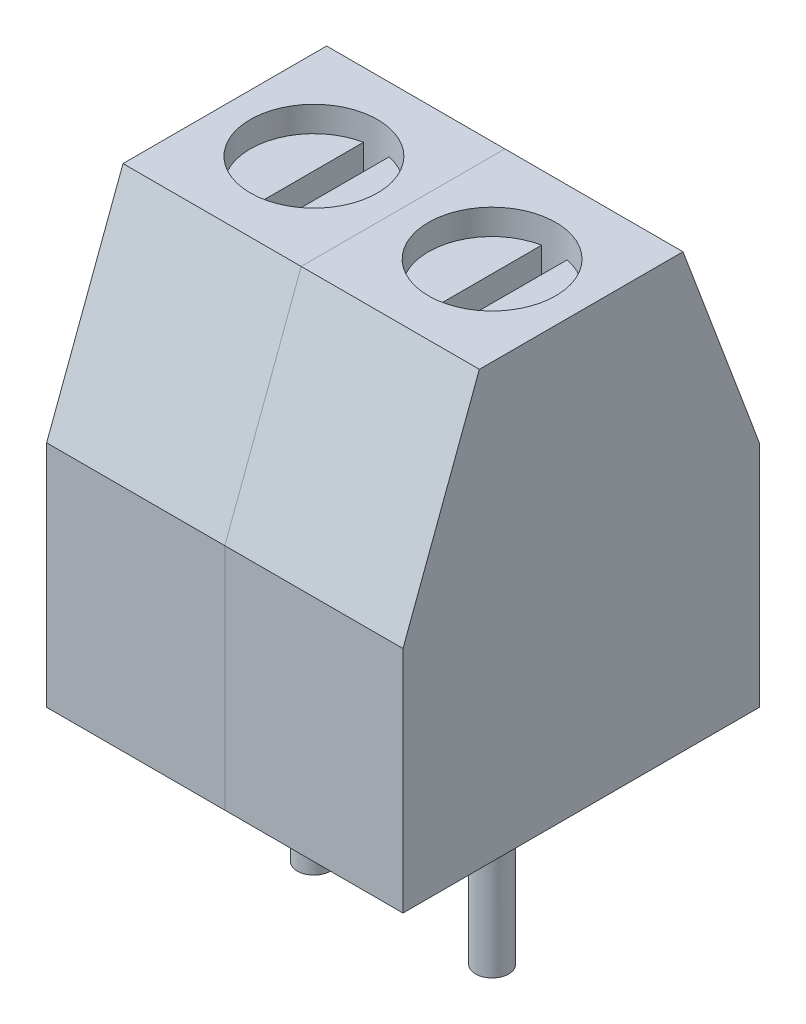
ISO-10303-21;
HEADER;
FILE_DESCRIPTION(('STEP AP214'),'2;1');
FILE_NAME('part.step','',(''),(''),'','','');
FILE_SCHEMA(('AUTOMOTIVE_DESIGN { 1 0 10303 214 1 1 1 1 }'));
ENDSEC;
DATA;
#1=APPLICATION_CONTEXT('core data for automotive mechanical design processes');
#2=APPLICATION_PROTOCOL_DEFINITION('international standard','automotive_design',2000,#1);
#3=PRODUCT_CONTEXT('',#1,'mechanical');
#4=PRODUCT('Part','Part','',(#3));
#5=PRODUCT_RELATED_PRODUCT_CATEGORY('part','',(#4));
#6=PRODUCT_DEFINITION_FORMATION('','',#4);
#7=PRODUCT_DEFINITION_CONTEXT('part definition',#1,'design');
#8=PRODUCT_DEFINITION('design','',#6,#7);
#9=PRODUCT_DEFINITION_SHAPE('','',#8);
#10=(LENGTH_UNIT() NAMED_UNIT(*) SI_UNIT(.MILLI.,.METRE.));
#11=(NAMED_UNIT(*) PLANE_ANGLE_UNIT() SI_UNIT($,.RADIAN.));
#12=(NAMED_UNIT(*) SI_UNIT($,.STERADIAN.) SOLID_ANGLE_UNIT());
#13=UNCERTAINTY_MEASURE_WITH_UNIT(LENGTH_MEASURE(1.E-05),#10,'distance_accuracy_value','');
#14=(GEOMETRIC_REPRESENTATION_CONTEXT(3) GLOBAL_UNCERTAINTY_ASSIGNED_CONTEXT((#13)) GLOBAL_UNIT_ASSIGNED_CONTEXT((#10,
#11,#12)) REPRESENTATION_CONTEXT('',''));
#15=CARTESIAN_POINT('',(0.,0.,0.));
#16=DIRECTION('',(0.,0.,1.));
#17=DIRECTION('',(1.,0.,0.));
#18=AXIS2_PLACEMENT_3D('',#15,#16,#17);
#19=CARTESIAN_POINT('',(5.25,8.,-3.5));
#20=DIRECTION('',(0.,1.,0.));
#21=DIRECTION('',(0.,0.,1.));
#22=AXIS2_PLACEMENT_3D('',#19,#20,#21);
#23=PLANE('',#22);
#24=DIRECTION('',(0.,0.,-1.));
#25=VECTOR('',#24,1.);
#26=CARTESIAN_POINT('',(5.49994995834108,8.,-4.72475508503753));
#27=LINE('',#26,#25);
#28=CARTESIAN_POINT('',(5.49994995834108,8.,-2.27524491496247));
#29=VERTEX_POINT('',#28);
#30=CARTESIAN_POINT('',(5.49994995834108,8.,-4.72475508503753));
#31=VERTEX_POINT('',#30);
#32=EDGE_CURVE('E176',#29,#31,#27,.T.);
#33=ORIENTED_EDGE('',*,*,#32,.F.);
#34=CARTESIAN_POINT('',(5.25,8.,-3.5));
#35=DIRECTION('',(0.,1.,0.));
#36=DIRECTION('',(0.,0.,1.));
#37=AXIS2_PLACEMENT_3D('',#34,#35,#36);
#38=CIRCLE('',#37,1.25);
#39=EDGE_CURVE('E158',#29,#31,#38,.T.);
#40=ORIENTED_EDGE('',*,*,#39,.T.);
#41=EDGE_LOOP('',(#33,#40));
#42=FACE_BOUND('',#41,.T.);
#43=ADVANCED_FACE('F48',(#42),#23,.T.);
#44=CARTESIAN_POINT('',(7.,0.,0.));
#45=DIRECTION('',(0.,0.,-1.));
#46=DIRECTION('',(-1.,0.,0.));
#47=AXIS2_PLACEMENT_3D('',#44,#45,#46);
#48=PLANE('',#47);
#49=DIRECTION('',(0.,-1.,0.));
#50=VECTOR('',#49,1.);
#51=CARTESIAN_POINT('',(3.5,0.,0.));
#52=LINE('',#51,#50);
#53=CARTESIAN_POINT('',(3.5,4.5,0.));
#54=VERTEX_POINT('',#53);
#55=CARTESIAN_POINT('',(3.5,0.,0.));
#56=VERTEX_POINT('',#55);
#57=EDGE_CURVE('E242',#54,#56,#52,.T.);
#58=ORIENTED_EDGE('',*,*,#57,.T.);
#59=DIRECTION('',(-1.,0.,0.));
#60=VECTOR('',#59,1.);
#61=CARTESIAN_POINT('',(7.,0.,0.));
#62=LINE('',#61,#60);
#63=CARTESIAN_POINT('',(7.,0.,0.));
#64=VERTEX_POINT('',#63);
#65=EDGE_CURVE('E56',#64,#56,#62,.T.);
#66=ORIENTED_EDGE('',*,*,#65,.F.);
#67=DIRECTION('',(0.,-1.,0.));
#68=VECTOR('',#67,1.);
#69=CARTESIAN_POINT('',(7.,0.,0.));
#70=LINE('',#69,#68);
#71=CARTESIAN_POINT('',(7.,4.5,0.));
#72=VERTEX_POINT('',#71);
#73=EDGE_CURVE('E232',#72,#64,#70,.T.);
#74=ORIENTED_EDGE('',*,*,#73,.F.);
#75=DIRECTION('',(-1.,0.,0.));
#76=VECTOR('',#75,1.);
#77=CARTESIAN_POINT('',(7.,4.5,0.));
#78=LINE('',#77,#76);
#79=EDGE_CURVE('E226',#72,#54,#78,.T.);
#80=ORIENTED_EDGE('',*,*,#79,.T.);
#81=EDGE_LOOP('',(#58,#66,#74,#80));
#82=FACE_BOUND('',#81,.T.);
#83=ADVANCED_FACE('F50',(#82),#48,.F.);
#84=CARTESIAN_POINT('',(7.,0.,0.));
#85=DIRECTION('',(0.,1.,0.));
#86=DIRECTION('',(0.,0.,1.));
#87=AXIS2_PLACEMENT_3D('',#84,#85,#86);
#88=PLANE('',#87);
#89=CARTESIAN_POINT('',(5.25,0.,-3.5));
#90=DIRECTION('',(0.,1.,0.));
#91=DIRECTION('',(0.,0.,1.));
#92=AXIS2_PLACEMENT_3D('',#89,#90,#91);
#93=CIRCLE('',#92,0.325);
#94=CARTESIAN_POINT('',(5.25,0.,-3.175));
#95=VERTEX_POINT('',#94);
#96=EDGE_CURVE('E12',#95,#95,#93,.F.);
#97=ORIENTED_EDGE('',*,*,#96,.F.);
#98=EDGE_LOOP('',(#97));
#99=FACE_BOUND('',#98,.T.);
#100=DIRECTION('',(0.,0.,-1.));
#101=VECTOR('',#100,1.);
#102=CARTESIAN_POINT('',(3.5,0.,0.));
#103=LINE('',#102,#101);
#104=CARTESIAN_POINT('',(3.5,0.,-7.));
#105=VERTEX_POINT('',#104);
#106=EDGE_CURVE('E240',#56,#105,#103,.T.);
#107=ORIENTED_EDGE('',*,*,#106,.T.);
#108=DIRECTION('',(-1.,0.,0.));
#109=VECTOR('',#108,1.);
#110=CARTESIAN_POINT('',(7.,0.,-7.));
#111=LINE('',#110,#109);
#112=CARTESIAN_POINT('',(7.,0.,-7.));
#113=VERTEX_POINT('',#112);
#114=EDGE_CURVE('E213',#113,#105,#111,.T.);
#115=ORIENTED_EDGE('',*,*,#114,.F.);
#116=DIRECTION('',(0.,0.,-1.));
#117=VECTOR('',#116,1.);
#118=CARTESIAN_POINT('',(7.,0.,0.));
#119=LINE('',#118,#117);
#120=EDGE_CURVE('E253',#64,#113,#119,.T.);
#121=ORIENTED_EDGE('',*,*,#120,.F.);
#122=ORIENTED_EDGE('',*,*,#65,.T.);
#123=EDGE_LOOP('',(#107,#115,#121,#122));
#124=FACE_BOUND('',#123,.T.);
#125=ADVANCED_FACE('F322',(#99,#124),#88,.F.);
#126=CARTESIAN_POINT('',(7.,0.,-7.));
#127=DIRECTION('',(0.,0.,1.));
#128=DIRECTION('',(1.,0.,0.));
#129=AXIS2_PLACEMENT_3D('',#126,#127,#128);
#130=PLANE('',#129);
#131=DIRECTION('',(-1.,0.,0.));
#132=VECTOR('',#131,1.);
#133=CARTESIAN_POINT('',(6.75,0.5,-7.));
#134=LINE('',#133,#132);
#135=CARTESIAN_POINT('',(6.75,0.5,-7.));
#136=VERTEX_POINT('',#135);
#137=CARTESIAN_POINT('',(3.75,0.5,-7.));
#138=VERTEX_POINT('',#137);
#139=EDGE_CURVE('E270',#136,#138,#134,.T.);
#140=ORIENTED_EDGE('',*,*,#139,.F.);
#141=DIRECTION('',(0.,-1.,0.));
#142=VECTOR('',#141,1.);
#143=CARTESIAN_POINT('',(6.75,0.5,-7.));
#144=LINE('',#143,#142);
#145=CARTESIAN_POINT('',(6.75,4.5,-7.));
#146=VERTEX_POINT('',#145);
#147=EDGE_CURVE('E210',#146,#136,#144,.T.);
#148=ORIENTED_EDGE('',*,*,#147,.F.);
#149=DIRECTION('',(-1.,0.,0.));
#150=VECTOR('',#149,1.);
#151=CARTESIAN_POINT('',(7.,4.5,-7.));
#152=LINE('',#151,#150);
#153=CARTESIAN_POINT('',(7.,4.5,-7.));
#154=VERTEX_POINT('',#153);
#155=EDGE_CURVE('E216',#154,#146,#152,.T.);
#156=ORIENTED_EDGE('',*,*,#155,.F.);
#157=DIRECTION('',(0.,1.,0.));
#158=VECTOR('',#157,1.);
#159=CARTESIAN_POINT('',(7.,0.,-7.));
#160=LINE('',#159,#158);
#161=EDGE_CURVE('E251',#113,#154,#160,.T.);
#162=ORIENTED_EDGE('',*,*,#161,.F.);
#163=ORIENTED_EDGE('',*,*,#114,.T.);
#164=DIRECTION('',(0.,1.,0.));
#165=VECTOR('',#164,1.);
#166=CARTESIAN_POINT('',(3.5,0.,-7.));
#167=LINE('',#166,#165);
#168=CARTESIAN_POINT('',(3.5,4.5,-7.));
#169=VERTEX_POINT('',#168);
#170=EDGE_CURVE('E237',#105,#169,#167,.T.);
#171=ORIENTED_EDGE('',*,*,#170,.T.);
#172=CARTESIAN_POINT('',(3.75,4.5,-7.));
#173=VERTEX_POINT('',#172);
#174=EDGE_CURVE('E219',#173,#169,#152,.T.);
#175=ORIENTED_EDGE('',*,*,#174,.F.);
#176=DIRECTION('',(0.,1.,0.));
#177=VECTOR('',#176,1.);
#178=CARTESIAN_POINT('',(3.75,0.5,-7.));
#179=LINE('',#178,#177);
#180=EDGE_CURVE('E71',#138,#173,#179,.T.);
#181=ORIENTED_EDGE('',*,*,#180,.F.);
#182=EDGE_LOOP('',(#140,#148,#156,#162,#163,#171,#175,#181));
#183=FACE_BOUND('',#182,.T.);
#184=ADVANCED_FACE('F320',(#183),#130,.F.);
#185=CARTESIAN_POINT('',(7.,8.5,-5.5));
#186=DIRECTION('',(0.,-0.351123441588392,0.936329177569045));
#187=DIRECTION('',(0.,-0.936329177569045,-0.351123441588392));
#188=AXIS2_PLACEMENT_3D('',#185,#186,#187);
#189=PLANE('',#188);
#190=DIRECTION('',(0.,0.936329177569045,0.351123441588392));
#191=VECTOR('',#190,1.);
#192=CARTESIAN_POINT('',(3.5,8.5,-5.5));
#193=LINE('',#192,#191);
#194=CARTESIAN_POINT('',(3.5,8.5,-5.5));
#195=VERTEX_POINT('',#194);
#196=EDGE_CURVE('E235',#169,#195,#193,.T.);
#197=ORIENTED_EDGE('',*,*,#196,.T.);
#198=DIRECTION('',(-1.,0.,0.));
#199=VECTOR('',#198,1.);
#200=CARTESIAN_POINT('',(7.,8.5,-5.5));
#201=LINE('',#200,#199);
#202=CARTESIAN_POINT('',(7.,8.5,-5.5));
#203=VERTEX_POINT('',#202);
#204=EDGE_CURVE('E220',#203,#195,#201,.T.);
#205=ORIENTED_EDGE('',*,*,#204,.F.);
#206=DIRECTION('',(0.,0.936329177569045,0.351123441588392));
#207=VECTOR('',#206,1.);
#208=CARTESIAN_POINT('',(7.,8.5,-5.5));
#209=LINE('',#208,#207);
#210=EDGE_CURVE('E249',#154,#203,#209,.T.);
#211=ORIENTED_EDGE('',*,*,#210,.F.);
#212=ORIENTED_EDGE('',*,*,#155,.T.);
#213=DIRECTION('',(1.,0.,0.));
#214=VECTOR('',#213,1.);
#215=CARTESIAN_POINT('',(6.75,4.5,-7.));
#216=LINE('',#215,#214);
#217=EDGE_CURVE('E265',#173,#146,#216,.T.);
#218=ORIENTED_EDGE('',*,*,#217,.F.);
#219=ORIENTED_EDGE('',*,*,#174,.T.);
#220=EDGE_LOOP('',(#197,#205,#211,#212,#218,#219));
#221=FACE_BOUND('',#220,.T.);
#222=ADVANCED_FACE('F291',(#221),#189,.F.);
#223=CARTESIAN_POINT('',(7.,8.5,-1.5));
#224=DIRECTION('',(0.,-1.,0.));
#225=DIRECTION('',(0.,0.,-1.));
#226=AXIS2_PLACEMENT_3D('',#223,#224,#225);
#227=PLANE('',#226);
#228=CARTESIAN_POINT('',(5.25,8.5,-3.5));
#229=DIRECTION('',(0.,1.,0.));
#230=DIRECTION('',(0.,0.,1.));
#231=AXIS2_PLACEMENT_3D('',#228,#229,#230);
#232=CIRCLE('',#231,1.25);
#233=CARTESIAN_POINT('',(5.25,8.5,-2.25));
#234=VERTEX_POINT('',#233);
#235=EDGE_CURVE('E196',#234,#234,#232,.T.);
#236=ORIENTED_EDGE('',*,*,#235,.F.);
#237=EDGE_LOOP('',(#236));
#238=FACE_BOUND('',#237,.T.);
#239=DIRECTION('',(0.,0.,1.));
#240=VECTOR('',#239,1.);
#241=CARTESIAN_POINT('',(3.5,8.5,-1.5));
#242=LINE('',#241,#240);
#243=CARTESIAN_POINT('',(3.5,8.5,-1.5));
#244=VERTEX_POINT('',#243);
#245=EDGE_CURVE('E233',#195,#244,#242,.T.);
#246=ORIENTED_EDGE('',*,*,#245,.T.);
#247=DIRECTION('',(-1.,0.,0.));
#248=VECTOR('',#247,1.);
#249=CARTESIAN_POINT('',(7.,8.5,-1.5));
#250=LINE('',#249,#248);
#251=CARTESIAN_POINT('',(7.,8.5,-1.5));
#252=VERTEX_POINT('',#251);
#253=EDGE_CURVE('E223',#252,#244,#250,.T.);
#254=ORIENTED_EDGE('',*,*,#253,.F.);
#255=DIRECTION('',(0.,0.,1.));
#256=VECTOR('',#255,1.);
#257=CARTESIAN_POINT('',(7.,8.5,-1.5));
#258=LINE('',#257,#256);
#259=EDGE_CURVE('E247',#203,#252,#258,.T.);
#260=ORIENTED_EDGE('',*,*,#259,.F.);
#261=ORIENTED_EDGE('',*,*,#204,.T.);
#262=EDGE_LOOP('',(#246,#254,#260,#261));
#263=FACE_BOUND('',#262,.T.);
#264=ADVANCED_FACE('F287',(#238,#263),#227,.F.);
#265=CARTESIAN_POINT('',(7.,8.5,-1.5));
#266=DIRECTION('',(0.,-0.351123441588392,-0.936329177569045));
#267=DIRECTION('',(0.,0.936329177569045,-0.351123441588392));
#268=AXIS2_PLACEMENT_3D('',#265,#266,#267);
#269=PLANE('',#268);
#270=DIRECTION('',(0.,-0.936329177569045,0.351123441588392));
#271=VECTOR('',#270,1.);
#272=CARTESIAN_POINT('',(3.5,8.5,-1.5));
#273=LINE('',#272,#271);
#274=EDGE_CURVE('E230',#244,#54,#273,.T.);
#275=ORIENTED_EDGE('',*,*,#274,.T.);
#276=ORIENTED_EDGE('',*,*,#79,.F.);
#277=DIRECTION('',(0.,-0.936329177569045,0.351123441588392));
#278=VECTOR('',#277,1.);
#279=CARTESIAN_POINT('',(7.,8.5,-1.5));
#280=LINE('',#279,#278);
#281=EDGE_CURVE('E229',#252,#72,#280,.T.);
#282=ORIENTED_EDGE('',*,*,#281,.F.);
#283=ORIENTED_EDGE('',*,*,#253,.T.);
#284=EDGE_LOOP('',(#275,#276,#282,#283));
#285=FACE_BOUND('',#284,.T.);
#286=ADVANCED_FACE('F290',(#285),#269,.F.);
#287=CARTESIAN_POINT('',(7.,0.,0.));
#288=DIRECTION('',(-1.,0.,0.));
#289=DIRECTION('',(0.,0.,1.));
#290=AXIS2_PLACEMENT_3D('',#287,#288,#289);
#291=PLANE('',#290);
#292=ORIENTED_EDGE('',*,*,#73,.T.);
#293=ORIENTED_EDGE('',*,*,#120,.T.);
#294=ORIENTED_EDGE('',*,*,#161,.T.);
#295=ORIENTED_EDGE('',*,*,#210,.T.);
#296=ORIENTED_EDGE('',*,*,#259,.T.);
#297=ORIENTED_EDGE('',*,*,#281,.T.);
#298=EDGE_LOOP('',(#292,#293,#294,#295,#296,#297));
#299=FACE_BOUND('',#298,.T.);
#300=ADVANCED_FACE('F310',(#299),#291,.F.);
#301=CARTESIAN_POINT('',(3.5,0.,0.));
#302=DIRECTION('',(-1.,0.,0.));
#303=DIRECTION('',(0.,0.,1.));
#304=AXIS2_PLACEMENT_3D('',#301,#302,#303);
#305=PLANE('',#304);
#306=ORIENTED_EDGE('',*,*,#57,.F.);
#307=ORIENTED_EDGE('',*,*,#274,.F.);
#308=ORIENTED_EDGE('',*,*,#245,.F.);
#309=ORIENTED_EDGE('',*,*,#196,.F.);
#310=ORIENTED_EDGE('',*,*,#170,.F.);
#311=ORIENTED_EDGE('',*,*,#106,.F.);
#312=EDGE_LOOP('',(#306,#307,#308,#309,#310,#311));
#313=FACE_BOUND('',#312,.T.);
#314=ADVANCED_FACE('F304',(#313),#305,.T.);
#315=CARTESIAN_POINT('',(6.75,0.5,-5.5));
#316=DIRECTION('',(1.,0.,0.));
#317=DIRECTION('',(0.,0.,-1.));
#318=AXIS2_PLACEMENT_3D('',#315,#316,#317);
#319=PLANE('',#318);
#320=ORIENTED_EDGE('',*,*,#147,.T.);
#321=DIRECTION('',(0.,0.,-1.));
#322=VECTOR('',#321,1.);
#323=CARTESIAN_POINT('',(6.75,0.5,-5.5));
#324=LINE('',#323,#322);
#325=CARTESIAN_POINT('',(6.75,0.5,-5.5));
#326=VERTEX_POINT('',#325);
#327=EDGE_CURVE('E257',#326,#136,#324,.T.);
#328=ORIENTED_EDGE('',*,*,#327,.F.);
#329=DIRECTION('',(0.,-1.,0.));
#330=VECTOR('',#329,1.);
#331=CARTESIAN_POINT('',(6.75,0.5,-5.5));
#332=LINE('',#331,#330);
#333=CARTESIAN_POINT('',(6.75,4.5,-5.5));
#334=VERTEX_POINT('',#333);
#335=EDGE_CURVE('E268',#334,#326,#332,.T.);
#336=ORIENTED_EDGE('',*,*,#335,.F.);
#337=DIRECTION('',(0.,0.,-1.));
#338=VECTOR('',#337,1.);
#339=CARTESIAN_POINT('',(6.75,4.5,-5.5));
#340=LINE('',#339,#338);
#341=EDGE_CURVE('E245',#334,#146,#340,.T.);
#342=ORIENTED_EDGE('',*,*,#341,.T.);
#343=EDGE_LOOP('',(#320,#328,#336,#342));
#344=FACE_BOUND('',#343,.T.);
#345=ADVANCED_FACE('F360',(#344),#319,.F.);
#346=CARTESIAN_POINT('',(6.75,4.5,-5.5));
#347=DIRECTION('',(0.,1.,0.));
#348=DIRECTION('',(0.,0.,1.));
#349=AXIS2_PLACEMENT_3D('',#346,#347,#348);
#350=PLANE('',#349);
#351=ORIENTED_EDGE('',*,*,#217,.T.);
#352=ORIENTED_EDGE('',*,*,#341,.F.);
#353=DIRECTION('',(1.,0.,0.));
#354=VECTOR('',#353,1.);
#355=CARTESIAN_POINT('',(6.75,4.5,-5.5));
#356=LINE('',#355,#354);
#357=CARTESIAN_POINT('',(3.75,4.5,-5.5));
#358=VERTEX_POINT('',#357);
#359=EDGE_CURVE('E260',#358,#334,#356,.T.);
#360=ORIENTED_EDGE('',*,*,#359,.F.);
#361=DIRECTION('',(0.,0.,-1.));
#362=VECTOR('',#361,1.);
#363=CARTESIAN_POINT('',(3.75,4.5,-5.5));
#364=LINE('',#363,#362);
#365=EDGE_CURVE('E262',#358,#173,#364,.T.);
#366=ORIENTED_EDGE('',*,*,#365,.T.);
#367=EDGE_LOOP('',(#351,#352,#360,#366));
#368=FACE_BOUND('',#367,.T.);
#369=ADVANCED_FACE('F356',(#368),#350,.F.);
#370=CARTESIAN_POINT('',(3.75,0.5,-5.5));
#371=DIRECTION('',(-1.,0.,0.));
#372=DIRECTION('',(0.,-1.,0.));
#373=AXIS2_PLACEMENT_3D('',#370,#371,#372);
#374=PLANE('',#373);
#375=ORIENTED_EDGE('',*,*,#180,.T.);
#376=ORIENTED_EDGE('',*,*,#365,.F.);
#377=DIRECTION('',(0.,1.,0.));
#378=VECTOR('',#377,1.);
#379=CARTESIAN_POINT('',(3.75,0.5,-5.5));
#380=LINE('',#379,#378);
#381=CARTESIAN_POINT('',(3.75,0.5,-5.5));
#382=VERTEX_POINT('',#381);
#383=EDGE_CURVE('E277',#382,#358,#380,.T.);
#384=ORIENTED_EDGE('',*,*,#383,.F.);
#385=DIRECTION('',(0.,0.,-1.));
#386=VECTOR('',#385,1.);
#387=CARTESIAN_POINT('',(3.75,0.5,-5.5));
#388=LINE('',#387,#386);
#389=EDGE_CURVE('E259',#382,#138,#388,.T.);
#390=ORIENTED_EDGE('',*,*,#389,.T.);
#391=EDGE_LOOP('',(#375,#376,#384,#390));
#392=FACE_BOUND('',#391,.T.);
#393=ADVANCED_FACE('F359',(#392),#374,.F.);
#394=CARTESIAN_POINT('',(6.75,0.5,-5.5));
#395=DIRECTION('',(0.,-1.,0.));
#396=DIRECTION('',(0.,0.,-1.));
#397=AXIS2_PLACEMENT_3D('',#394,#395,#396);
#398=PLANE('',#397);
#399=ORIENTED_EDGE('',*,*,#139,.T.);
#400=ORIENTED_EDGE('',*,*,#389,.F.);
#401=DIRECTION('',(-1.,0.,0.));
#402=VECTOR('',#401,1.);
#403=CARTESIAN_POINT('',(6.75,0.5,-5.5));
#404=LINE('',#403,#402);
#405=EDGE_CURVE('E280',#326,#382,#404,.T.);
#406=ORIENTED_EDGE('',*,*,#405,.F.);
#407=ORIENTED_EDGE('',*,*,#327,.T.);
#408=EDGE_LOOP('',(#399,#400,#406,#407));
#409=FACE_BOUND('',#408,.T.);
#410=ADVANCED_FACE('F352',(#409),#398,.F.);
#411=CARTESIAN_POINT('',(3.5,0.,-5.5));
#412=DIRECTION('',(0.,0.,1.));
#413=DIRECTION('',(1.,0.,0.));
#414=AXIS2_PLACEMENT_3D('',#411,#412,#413);
#415=PLANE('',#414);
#416=CARTESIAN_POINT('',(5.25,2.,-5.5));
#417=DIRECTION('',(0.,0.,-1.));
#418=DIRECTION('',(-1.,0.,0.));
#419=AXIS2_PLACEMENT_3D('',#416,#417,#418);
#420=CIRCLE('',#419,1.);
#421=CARTESIAN_POINT('',(4.25,2.,-5.5));
#422=VERTEX_POINT('',#421);
#423=EDGE_CURVE('E179',#422,#422,#420,.T.);
#424=ORIENTED_EDGE('',*,*,#423,.F.);
#425=EDGE_LOOP('',(#424));
#426=FACE_BOUND('',#425,.T.);
#427=ORIENTED_EDGE('',*,*,#335,.T.);
#428=ORIENTED_EDGE('',*,*,#405,.T.);
#429=ORIENTED_EDGE('',*,*,#383,.T.);
#430=ORIENTED_EDGE('',*,*,#359,.T.);
#431=EDGE_LOOP('',(#427,#428,#429,#430));
#432=FACE_BOUND('',#431,.T.);
#433=ADVANCED_FACE('F347',(#426,#432),#415,.F.);
#434=CARTESIAN_POINT('',(5.25,8.,-3.5));
#435=DIRECTION('',(0.,1.,0.));
#436=DIRECTION('',(0.,0.,1.));
#437=AXIS2_PLACEMENT_3D('',#434,#435,#436);
#438=CYLINDRICAL_SURFACE('',#437,1.25);
#439=ORIENTED_EDGE('',*,*,#39,.F.);
#440=DIRECTION('',(0.,1.,0.));
#441=VECTOR('',#440,1.);
#442=CARTESIAN_POINT('',(5.49994995834108,7.5,-2.27524491496247));
#443=LINE('',#442,#441);
#444=CARTESIAN_POINT('',(5.49994995834108,7.5,-2.27524491496247));
#445=VERTEX_POINT('',#444);
#446=EDGE_CURVE('E150',#445,#29,#443,.T.);
#447=ORIENTED_EDGE('',*,*,#446,.F.);
#448=CARTESIAN_POINT('',(5.25,7.5,-3.5));
#449=DIRECTION('',(0.,1.,0.));
#450=DIRECTION('',(0.,0.,1.));
#451=AXIS2_PLACEMENT_3D('',#448,#449,#450);
#452=CIRCLE('',#451,1.25);
#453=CARTESIAN_POINT('',(5.00005004165892,7.5,-2.27524491496247));
#454=VERTEX_POINT('',#453);
#455=EDGE_CURVE('E155',#454,#445,#452,.T.);
#456=ORIENTED_EDGE('',*,*,#455,.F.);
#457=DIRECTION('',(0.,1.,0.));
#458=VECTOR('',#457,1.);
#459=CARTESIAN_POINT('',(5.00005004165892,7.5,-2.27524491496247));
#460=LINE('',#459,#458);
#461=CARTESIAN_POINT('',(5.00005004165892,8.,-2.27524491496247));
#462=VERTEX_POINT('',#461);
#463=EDGE_CURVE('E194',#454,#462,#460,.T.);
#464=ORIENTED_EDGE('',*,*,#463,.T.);
#465=CARTESIAN_POINT('',(5.00005004165892,8.,-4.72475508503753));
#466=VERTEX_POINT('',#465);
#467=EDGE_CURVE('E203',#466,#462,#38,.T.);
#468=ORIENTED_EDGE('',*,*,#467,.F.);
#469=DIRECTION('',(0.,1.,0.));
#470=VECTOR('',#469,1.);
#471=CARTESIAN_POINT('',(5.00005004165892,7.5,-4.72475508503753));
#472=LINE('',#471,#470);
#473=CARTESIAN_POINT('',(5.00005004165892,7.5,-4.72475508503753));
#474=VERTEX_POINT('',#473);
#475=EDGE_CURVE('E63',#474,#466,#472,.T.);
#476=ORIENTED_EDGE('',*,*,#475,.F.);
#477=CARTESIAN_POINT('',(5.25,7.5,-3.5));
#478=DIRECTION('',(0.,1.,0.));
#479=DIRECTION('',(0.,0.,1.));
#480=AXIS2_PLACEMENT_3D('',#477,#478,#479);
#481=CIRCLE('',#480,1.25);
#482=CARTESIAN_POINT('',(5.49994995834108,7.5,-4.72475508503753));
#483=VERTEX_POINT('',#482);
#484=EDGE_CURVE('E171',#483,#474,#481,.T.);
#485=ORIENTED_EDGE('',*,*,#484,.F.);
#486=DIRECTION('',(0.,1.,0.));
#487=VECTOR('',#486,1.);
#488=CARTESIAN_POINT('',(5.49994995834108,7.5,-4.72475508503753));
#489=LINE('',#488,#487);
#490=EDGE_CURVE('E162',#483,#31,#489,.T.);
#491=ORIENTED_EDGE('',*,*,#490,.T.);
#492=EDGE_LOOP('',(#439,#447,#456,#464,#468,#476,#485,#491));
#493=FACE_BOUND('',#492,.T.);
#494=ORIENTED_EDGE('',*,*,#235,.T.);
#495=EDGE_LOOP('',(#494));
#496=FACE_BOUND('',#495,.T.);
#497=ADVANCED_FACE('F152',(#493,#496),#438,.F.);
#498=DIRECTION('',(0.,0.,1.));
#499=VECTOR('',#498,1.);
#500=CARTESIAN_POINT('',(5.00005004165892,8.,-4.72475508503753));
#501=LINE('',#500,#499);
#502=EDGE_CURVE('E174',#466,#462,#501,.T.);
#503=ORIENTED_EDGE('',*,*,#502,.F.);
#504=ORIENTED_EDGE('',*,*,#467,.T.);
#505=EDGE_LOOP('',(#503,#504));
#506=FACE_BOUND('',#505,.T.);
#507=ADVANCED_FACE('F334',(#506),#23,.T.);
#508=CARTESIAN_POINT('',(5.00005004165892,7.5,-4.72475508503753));
#509=DIRECTION('',(-1.,0.,0.));
#510=DIRECTION('',(0.,0.,1.));
#511=AXIS2_PLACEMENT_3D('',#508,#509,#510);
#512=PLANE('',#511);
#513=ORIENTED_EDGE('',*,*,#502,.T.);
#514=ORIENTED_EDGE('',*,*,#463,.F.);
#515=DIRECTION('',(0.,0.,1.));
#516=VECTOR('',#515,1.);
#517=CARTESIAN_POINT('',(5.00005004165892,7.5,-4.72475508503753));
#518=LINE('',#517,#516);
#519=EDGE_CURVE('E163',#474,#454,#518,.T.);
#520=ORIENTED_EDGE('',*,*,#519,.F.);
#521=ORIENTED_EDGE('',*,*,#475,.T.);
#522=EDGE_LOOP('',(#513,#514,#520,#521));
#523=FACE_BOUND('',#522,.T.);
#524=ADVANCED_FACE('F340',(#523),#512,.F.);
#525=CARTESIAN_POINT('',(5.49994995834108,7.5,-4.72475508503753));
#526=DIRECTION('',(1.,0.,0.));
#527=DIRECTION('',(0.,0.,-1.));
#528=AXIS2_PLACEMENT_3D('',#525,#526,#527);
#529=PLANE('',#528);
#530=ORIENTED_EDGE('',*,*,#32,.T.);
#531=ORIENTED_EDGE('',*,*,#490,.F.);
#532=DIRECTION('',(0.,0.,-1.));
#533=VECTOR('',#532,1.);
#534=CARTESIAN_POINT('',(5.49994995834108,7.5,-4.72475508503753));
#535=LINE('',#534,#533);
#536=EDGE_CURVE('E166',#445,#483,#535,.T.);
#537=ORIENTED_EDGE('',*,*,#536,.F.);
#538=ORIENTED_EDGE('',*,*,#446,.T.);
#539=EDGE_LOOP('',(#530,#531,#537,#538));
#540=FACE_BOUND('',#539,.T.);
#541=ADVANCED_FACE('F167',(#540),#529,.F.);
#542=CARTESIAN_POINT('',(5.25,7.5,-3.5));
#543=DIRECTION('',(0.,1.,0.));
#544=DIRECTION('',(0.,0.,1.));
#545=AXIS2_PLACEMENT_3D('',#542,#543,#544);
#546=PLANE('',#545);
#547=ORIENTED_EDGE('',*,*,#455,.T.);
#548=ORIENTED_EDGE('',*,*,#536,.T.);
#549=ORIENTED_EDGE('',*,*,#484,.T.);
#550=ORIENTED_EDGE('',*,*,#519,.T.);
#551=EDGE_LOOP('',(#547,#548,#549,#550));
#552=FACE_BOUND('',#551,.T.);
#553=ADVANCED_FACE('F173',(#552),#546,.T.);
#554=CARTESIAN_POINT('',(5.25,2.,-2.5));
#555=DIRECTION('',(0.,0.,-1.));
#556=DIRECTION('',(-1.,0.,0.));
#557=AXIS2_PLACEMENT_3D('',#554,#555,#556);
#558=CYLINDRICAL_SURFACE('',#557,1.);
#559=CARTESIAN_POINT('',(5.25,2.,-2.5));
#560=DIRECTION('',(0.,0.,-1.));
#561=DIRECTION('',(-1.,0.,0.));
#562=AXIS2_PLACEMENT_3D('',#559,#560,#561);
#563=CIRCLE('',#562,1.);
#564=CARTESIAN_POINT('',(4.25,2.,-2.5));
#565=VERTEX_POINT('',#564);
#566=EDGE_CURVE('E191',#565,#565,#563,.T.);
#567=ORIENTED_EDGE('',*,*,#566,.F.);
#568=EDGE_LOOP('',(#567));
#569=FACE_BOUND('',#568,.T.);
#570=ORIENTED_EDGE('',*,*,#423,.T.);
#571=EDGE_LOOP('',(#570));
#572=FACE_BOUND('',#571,.T.);
#573=ADVANCED_FACE('F426',(#569,#572),#558,.F.);
#574=CARTESIAN_POINT('',(5.25,2.,-2.5));
#575=DIRECTION('',(0.,0.,-1.));
#576=DIRECTION('',(-1.,0.,0.));
#577=AXIS2_PLACEMENT_3D('',#574,#575,#576);
#578=PLANE('',#577);
#579=ORIENTED_EDGE('',*,*,#566,.T.);
#580=EDGE_LOOP('',(#579));
#581=FACE_BOUND('',#580,.T.);
#582=ADVANCED_FACE('F431',(#581),#578,.T.);
#583=CARTESIAN_POINT('',(5.25,-3.5,-3.5));
#584=DIRECTION('',(0.,1.,0.));
#585=DIRECTION('',(0.,0.,1.));
#586=AXIS2_PLACEMENT_3D('',#583,#584,#585);
#587=CYLINDRICAL_SURFACE('',#586,0.325);
#588=CARTESIAN_POINT('',(5.25,-3.5,-3.5));
#589=DIRECTION('',(0.,-1.,0.));
#590=DIRECTION('',(0.,0.,-1.));
#591=AXIS2_PLACEMENT_3D('',#588,#589,#590);
#592=CIRCLE('',#591,0.325);
#593=CARTESIAN_POINT('',(5.25,-3.5,-3.825));
#594=VERTEX_POINT('',#593);
#595=EDGE_CURVE('E569',#594,#594,#592,.T.);
#596=ORIENTED_EDGE('',*,*,#595,.F.);
#597=EDGE_LOOP('',(#596));
#598=FACE_BOUND('',#597,.T.);
#599=ORIENTED_EDGE('',*,*,#96,.T.);
#600=EDGE_LOOP('',(#599));
#601=FACE_BOUND('',#600,.T.);
#602=ADVANCED_FACE('F537',(#598,#601),#587,.T.);
#603=CARTESIAN_POINT('',(3.5,-3.5,0.));
#604=DIRECTION('',(0.,-1.,0.));
#605=DIRECTION('',(0.,0.,-1.));
#606=AXIS2_PLACEMENT_3D('',#603,#604,#605);
#607=PLANE('',#606);
#608=ORIENTED_EDGE('',*,*,#595,.T.);
#609=EDGE_LOOP('',(#608));
#610=FACE_BOUND('',#609,.T.);
#611=ADVANCED_FACE('F547',(#610),#607,.T.);
#612=CLOSED_SHELL('',(#43,#83,#125,#184,#222,#264,#286,#300,#314,#345,#369,#393,#410,#433,#497,
#507,#524,#541,#553,#573,#582,#602,#611));
#613=MANIFOLD_SOLID_BREP('B2',#612);
#614=CARTESIAN_POINT('',(1.75,8.,-3.5));
#615=DIRECTION('',(0.,1.,0.));
#616=DIRECTION('',(0.,0.,1.));
#617=AXIS2_PLACEMENT_3D('',#614,#615,#616);
#618=PLANE('',#617);
#619=DIRECTION('',(0.,0.,-1.));
#620=VECTOR('',#619,1.);
#621=CARTESIAN_POINT('',(1.99994995834108,8.,-4.72475508503753));
#622=LINE('',#621,#620);
#623=CARTESIAN_POINT('',(1.99994995834108,8.,-2.27524491496247));
#624=VERTEX_POINT('',#623);
#625=CARTESIAN_POINT('',(1.99994995834108,8.,-4.72475508503753));
#626=VERTEX_POINT('',#625);
#627=EDGE_CURVE('E724',#624,#626,#622,.T.);
#628=ORIENTED_EDGE('',*,*,#627,.F.);
#629=CARTESIAN_POINT('',(1.75,8.,-3.5));
#630=DIRECTION('',(0.,1.,0.));
#631=DIRECTION('',(0.,0.,1.));
#632=AXIS2_PLACEMENT_3D('',#629,#630,#631);
#633=CIRCLE('',#632,1.25);
#634=EDGE_CURVE('E706',#624,#626,#633,.T.);
#635=ORIENTED_EDGE('',*,*,#634,.T.);
#636=EDGE_LOOP('',(#628,#635));
#637=FACE_BOUND('',#636,.T.);
#638=ADVANCED_FACE('F596',(#637),#618,.T.);
#639=CARTESIAN_POINT('',(3.5,0.,0.));
#640=DIRECTION('',(0.,0.,-1.));
#641=DIRECTION('',(-1.,0.,0.));
#642=AXIS2_PLACEMENT_3D('',#639,#640,#641);
#643=PLANE('',#642);
#644=DIRECTION('',(0.,-1.,0.));
#645=VECTOR('',#644,1.);
#646=CARTESIAN_POINT('',(0.,0.,0.));
#647=LINE('',#646,#645);
#648=CARTESIAN_POINT('',(0.,4.5,0.));
#649=VERTEX_POINT('',#648);
#650=CARTESIAN_POINT('',(0.,0.,0.));
#651=VERTEX_POINT('',#650);
#652=EDGE_CURVE('E790',#649,#651,#647,.T.);
#653=ORIENTED_EDGE('',*,*,#652,.T.);
#654=DIRECTION('',(-1.,0.,0.));
#655=VECTOR('',#654,1.);
#656=CARTESIAN_POINT('',(3.5,0.,0.));
#657=LINE('',#656,#655);
#658=CARTESIAN_POINT('',(3.5,0.,0.));
#659=VERTEX_POINT('',#658);
#660=EDGE_CURVE('E604',#659,#651,#657,.T.);
#661=ORIENTED_EDGE('',*,*,#660,.F.);
#662=DIRECTION('',(0.,-1.,0.));
#663=VECTOR('',#662,1.);
#664=CARTESIAN_POINT('',(3.5,0.,0.));
#665=LINE('',#664,#663);
#666=CARTESIAN_POINT('',(3.5,4.5,0.));
#667=VERTEX_POINT('',#666);
#668=EDGE_CURVE('E780',#667,#659,#665,.T.);
#669=ORIENTED_EDGE('',*,*,#668,.F.);
#670=DIRECTION('',(-1.,0.,0.));
#671=VECTOR('',#670,1.);
#672=CARTESIAN_POINT('',(3.5,4.5,0.));
#673=LINE('',#672,#671);
#674=EDGE_CURVE('E774',#667,#649,#673,.T.);
#675=ORIENTED_EDGE('',*,*,#674,.T.);
#676=EDGE_LOOP('',(#653,#661,#669,#675));
#677=FACE_BOUND('',#676,.T.);
#678=ADVANCED_FACE('F598',(#677),#643,.F.);
#679=CARTESIAN_POINT('',(3.5,0.,0.));
#680=DIRECTION('',(0.,1.,0.));
#681=DIRECTION('',(0.,0.,1.));
#682=AXIS2_PLACEMENT_3D('',#679,#680,#681);
#683=PLANE('',#682);
#684=CARTESIAN_POINT('',(1.75,0.,-3.5));
#685=DIRECTION('',(0.,1.,0.));
#686=DIRECTION('',(0.,0.,1.));
#687=AXIS2_PLACEMENT_3D('',#684,#685,#686);
#688=CIRCLE('',#687,0.325);
#689=CARTESIAN_POINT('',(1.75,0.,-3.175));
#690=VERTEX_POINT('',#689);
#691=EDGE_CURVE('E46',#690,#690,#688,.F.);
#692=ORIENTED_EDGE('',*,*,#691,.F.);
#693=EDGE_LOOP('',(#692));
#694=FACE_BOUND('',#693,.T.);
#695=DIRECTION('',(0.,0.,-1.));
#696=VECTOR('',#695,1.);
#697=CARTESIAN_POINT('',(0.,0.,0.));
#698=LINE('',#697,#696);
#699=CARTESIAN_POINT('',(0.,0.,-7.));
#700=VERTEX_POINT('',#699);
#701=EDGE_CURVE('E788',#651,#700,#698,.T.);
#702=ORIENTED_EDGE('',*,*,#701,.T.);
#703=DIRECTION('',(-1.,0.,0.));
#704=VECTOR('',#703,1.);
#705=CARTESIAN_POINT('',(3.5,0.,-7.));
#706=LINE('',#705,#704);
#707=CARTESIAN_POINT('',(3.5,0.,-7.));
#708=VERTEX_POINT('',#707);
#709=EDGE_CURVE('E761',#708,#700,#706,.T.);
#710=ORIENTED_EDGE('',*,*,#709,.F.);
#711=DIRECTION('',(0.,0.,-1.));
#712=VECTOR('',#711,1.);
#713=CARTESIAN_POINT('',(3.5,0.,0.));
#714=LINE('',#713,#712);
#715=EDGE_CURVE('E801',#659,#708,#714,.T.);
#716=ORIENTED_EDGE('',*,*,#715,.F.);
#717=ORIENTED_EDGE('',*,*,#660,.T.);
#718=EDGE_LOOP('',(#702,#710,#716,#717));
#719=FACE_BOUND('',#718,.T.);
#720=ADVANCED_FACE('F870',(#694,#719),#683,.F.);
#721=CARTESIAN_POINT('',(3.5,0.,-7.));
#722=DIRECTION('',(0.,0.,1.));
#723=DIRECTION('',(1.,0.,0.));
#724=AXIS2_PLACEMENT_3D('',#721,#722,#723);
#725=PLANE('',#724);
#726=DIRECTION('',(-1.,0.,0.));
#727=VECTOR('',#726,1.);
#728=CARTESIAN_POINT('',(3.25,0.5,-7.));
#729=LINE('',#728,#727);
#730=CARTESIAN_POINT('',(3.25,0.5,-7.));
#731=VERTEX_POINT('',#730);
#732=CARTESIAN_POINT('',(0.25,0.5,-7.));
#733=VERTEX_POINT('',#732);
#734=EDGE_CURVE('E818',#731,#733,#729,.T.);
#735=ORIENTED_EDGE('',*,*,#734,.F.);
#736=DIRECTION('',(0.,-1.,0.));
#737=VECTOR('',#736,1.);
#738=CARTESIAN_POINT('',(3.25,0.5,-7.));
#739=LINE('',#738,#737);
#740=CARTESIAN_POINT('',(3.25,4.5,-7.));
#741=VERTEX_POINT('',#740);
#742=EDGE_CURVE('E758',#741,#731,#739,.T.);
#743=ORIENTED_EDGE('',*,*,#742,.F.);
#744=DIRECTION('',(-1.,0.,0.));
#745=VECTOR('',#744,1.);
#746=CARTESIAN_POINT('',(3.5,4.5,-7.));
#747=LINE('',#746,#745);
#748=CARTESIAN_POINT('',(3.5,4.5,-7.));
#749=VERTEX_POINT('',#748);
#750=EDGE_CURVE('E764',#749,#741,#747,.T.);
#751=ORIENTED_EDGE('',*,*,#750,.F.);
#752=DIRECTION('',(0.,1.,0.));
#753=VECTOR('',#752,1.);
#754=CARTESIAN_POINT('',(3.5,0.,-7.));
#755=LINE('',#754,#753);
#756=EDGE_CURVE('E799',#708,#749,#755,.T.);
#757=ORIENTED_EDGE('',*,*,#756,.F.);
#758=ORIENTED_EDGE('',*,*,#709,.T.);
#759=DIRECTION('',(0.,1.,0.));
#760=VECTOR('',#759,1.);
#761=CARTESIAN_POINT('',(0.,0.,-7.));
#762=LINE('',#761,#760);
#763=CARTESIAN_POINT('',(0.,4.5,-7.));
#764=VERTEX_POINT('',#763);
#765=EDGE_CURVE('E785',#700,#764,#762,.T.);
#766=ORIENTED_EDGE('',*,*,#765,.T.);
#767=CARTESIAN_POINT('',(0.25,4.5,-7.));
#768=VERTEX_POINT('',#767);
#769=EDGE_CURVE('E767',#768,#764,#747,.T.);
#770=ORIENTED_EDGE('',*,*,#769,.F.);
#771=DIRECTION('',(0.,1.,0.));
#772=VECTOR('',#771,1.);
#773=CARTESIAN_POINT('',(0.25,0.5,-7.));
#774=LINE('',#773,#772);
#775=EDGE_CURVE('E619',#733,#768,#774,.T.);
#776=ORIENTED_EDGE('',*,*,#775,.F.);
#777=EDGE_LOOP('',(#735,#743,#751,#757,#758,#766,#770,#776));
#778=FACE_BOUND('',#777,.T.);
#779=ADVANCED_FACE('F868',(#778),#725,.F.);
#780=CARTESIAN_POINT('',(3.5,8.5,-5.5));
#781=DIRECTION('',(0.,-0.351123441588392,0.936329177569045));
#782=DIRECTION('',(0.,-0.936329177569045,-0.351123441588392));
#783=AXIS2_PLACEMENT_3D('',#780,#781,#782);
#784=PLANE('',#783);
#785=DIRECTION('',(0.,0.936329177569045,0.351123441588392));
#786=VECTOR('',#785,1.);
#787=CARTESIAN_POINT('',(0.,8.5,-5.5));
#788=LINE('',#787,#786);
#789=CARTESIAN_POINT('',(0.,8.5,-5.5));
#790=VERTEX_POINT('',#789);
#791=EDGE_CURVE('E783',#764,#790,#788,.T.);
#792=ORIENTED_EDGE('',*,*,#791,.T.);
#793=DIRECTION('',(-1.,0.,0.));
#794=VECTOR('',#793,1.);
#795=CARTESIAN_POINT('',(3.5,8.5,-5.5));
#796=LINE('',#795,#794);
#797=CARTESIAN_POINT('',(3.5,8.5,-5.5));
#798=VERTEX_POINT('',#797);
#799=EDGE_CURVE('E768',#798,#790,#796,.T.);
#800=ORIENTED_EDGE('',*,*,#799,.F.);
#801=DIRECTION('',(0.,0.936329177569045,0.351123441588392));
#802=VECTOR('',#801,1.);
#803=CARTESIAN_POINT('',(3.5,8.5,-5.5));
#804=LINE('',#803,#802);
#805=EDGE_CURVE('E797',#749,#798,#804,.T.);
#806=ORIENTED_EDGE('',*,*,#805,.F.);
#807=ORIENTED_EDGE('',*,*,#750,.T.);
#808=DIRECTION('',(1.,0.,0.));
#809=VECTOR('',#808,1.);
#810=CARTESIAN_POINT('',(3.25,4.5,-7.));
#811=LINE('',#810,#809);
#812=EDGE_CURVE('E813',#768,#741,#811,.T.);
#813=ORIENTED_EDGE('',*,*,#812,.F.);
#814=ORIENTED_EDGE('',*,*,#769,.T.);
#815=EDGE_LOOP('',(#792,#800,#806,#807,#813,#814));
#816=FACE_BOUND('',#815,.T.);
#817=ADVANCED_FACE('F839',(#816),#784,.F.);
#818=CARTESIAN_POINT('',(3.5,8.5,-1.5));
#819=DIRECTION('',(0.,-1.,0.));
#820=DIRECTION('',(0.,0.,-1.));
#821=AXIS2_PLACEMENT_3D('',#818,#819,#820);
#822=PLANE('',#821);
#823=CARTESIAN_POINT('',(1.75,8.5,-3.5));
#824=DIRECTION('',(0.,1.,0.));
#825=DIRECTION('',(0.,0.,1.));
#826=AXIS2_PLACEMENT_3D('',#823,#824,#825);
#827=CIRCLE('',#826,1.25);
#828=CARTESIAN_POINT('',(1.75,8.5,-2.25));
#829=VERTEX_POINT('',#828);
#830=EDGE_CURVE('E744',#829,#829,#827,.T.);
#831=ORIENTED_EDGE('',*,*,#830,.F.);
#832=EDGE_LOOP('',(#831));
#833=FACE_BOUND('',#832,.T.);
#834=DIRECTION('',(0.,0.,1.));
#835=VECTOR('',#834,1.);
#836=CARTESIAN_POINT('',(0.,8.5,-1.5));
#837=LINE('',#836,#835);
#838=CARTESIAN_POINT('',(0.,8.5,-1.5));
#839=VERTEX_POINT('',#838);
#840=EDGE_CURVE('E781',#790,#839,#837,.T.);
#841=ORIENTED_EDGE('',*,*,#840,.T.);
#842=DIRECTION('',(-1.,0.,0.));
#843=VECTOR('',#842,1.);
#844=CARTESIAN_POINT('',(3.5,8.5,-1.5));
#845=LINE('',#844,#843);
#846=CARTESIAN_POINT('',(3.5,8.5,-1.5));
#847=VERTEX_POINT('',#846);
#848=EDGE_CURVE('E771',#847,#839,#845,.T.);
#849=ORIENTED_EDGE('',*,*,#848,.F.);
#850=DIRECTION('',(0.,0.,1.));
#851=VECTOR('',#850,1.);
#852=CARTESIAN_POINT('',(3.5,8.5,-1.5));
#853=LINE('',#852,#851);
#854=EDGE_CURVE('E795',#798,#847,#853,.T.);
#855=ORIENTED_EDGE('',*,*,#854,.F.);
#856=ORIENTED_EDGE('',*,*,#799,.T.);
#857=EDGE_LOOP('',(#841,#849,#855,#856));
#858=FACE_BOUND('',#857,.T.);
#859=ADVANCED_FACE('F835',(#833,#858),#822,.F.);
#860=CARTESIAN_POINT('',(3.5,8.5,-1.5));
#861=DIRECTION('',(0.,-0.351123441588392,-0.936329177569045));
#862=DIRECTION('',(0.,0.936329177569045,-0.351123441588392));
#863=AXIS2_PLACEMENT_3D('',#860,#861,#862);
#864=PLANE('',#863);
#865=DIRECTION('',(0.,-0.936329177569045,0.351123441588392));
#866=VECTOR('',#865,1.);
#867=CARTESIAN_POINT('',(0.,8.5,-1.5));
#868=LINE('',#867,#866);
#869=EDGE_CURVE('E778',#839,#649,#868,.T.);
#870=ORIENTED_EDGE('',*,*,#869,.T.);
#871=ORIENTED_EDGE('',*,*,#674,.F.);
#872=DIRECTION('',(0.,-0.936329177569045,0.351123441588392));
#873=VECTOR('',#872,1.);
#874=CARTESIAN_POINT('',(3.5,8.5,-1.5));
#875=LINE('',#874,#873);
#876=EDGE_CURVE('E777',#847,#667,#875,.T.);
#877=ORIENTED_EDGE('',*,*,#876,.F.);
#878=ORIENTED_EDGE('',*,*,#848,.T.);
#879=EDGE_LOOP('',(#870,#871,#877,#878));
#880=FACE_BOUND('',#879,.T.);
#881=ADVANCED_FACE('F838',(#880),#864,.F.);
#882=CARTESIAN_POINT('',(3.5,0.,0.));
#883=DIRECTION('',(-1.,0.,0.));
#884=DIRECTION('',(0.,0.,1.));
#885=AXIS2_PLACEMENT_3D('',#882,#883,#884);
#886=PLANE('',#885);
#887=ORIENTED_EDGE('',*,*,#668,.T.);
#888=ORIENTED_EDGE('',*,*,#715,.T.);
#889=ORIENTED_EDGE('',*,*,#756,.T.);
#890=ORIENTED_EDGE('',*,*,#805,.T.);
#891=ORIENTED_EDGE('',*,*,#854,.T.);
#892=ORIENTED_EDGE('',*,*,#876,.T.);
#893=EDGE_LOOP('',(#887,#888,#889,#890,#891,#892));
#894=FACE_BOUND('',#893,.T.);
#895=ADVANCED_FACE('F858',(#894),#886,.F.);
#896=CARTESIAN_POINT('',(0.,0.,0.));
#897=DIRECTION('',(-1.,0.,0.));
#898=DIRECTION('',(0.,0.,1.));
#899=AXIS2_PLACEMENT_3D('',#896,#897,#898);
#900=PLANE('',#899);
#901=ORIENTED_EDGE('',*,*,#652,.F.);
#902=ORIENTED_EDGE('',*,*,#869,.F.);
#903=ORIENTED_EDGE('',*,*,#840,.F.);
#904=ORIENTED_EDGE('',*,*,#791,.F.);
#905=ORIENTED_EDGE('',*,*,#765,.F.);
#906=ORIENTED_EDGE('',*,*,#701,.F.);
#907=EDGE_LOOP('',(#901,#902,#903,#904,#905,#906));
#908=FACE_BOUND('',#907,.T.);
#909=ADVANCED_FACE('F852',(#908),#900,.T.);
#910=CARTESIAN_POINT('',(3.25,0.5,-5.5));
#911=DIRECTION('',(1.,0.,0.));
#912=DIRECTION('',(0.,0.,-1.));
#913=AXIS2_PLACEMENT_3D('',#910,#911,#912);
#914=PLANE('',#913);
#915=ORIENTED_EDGE('',*,*,#742,.T.);
#916=DIRECTION('',(0.,0.,-1.));
#917=VECTOR('',#916,1.);
#918=CARTESIAN_POINT('',(3.25,0.5,-5.5));
#919=LINE('',#918,#917);
#920=CARTESIAN_POINT('',(3.25,0.5,-5.5));
#921=VERTEX_POINT('',#920);
#922=EDGE_CURVE('E805',#921,#731,#919,.T.);
#923=ORIENTED_EDGE('',*,*,#922,.F.);
#924=DIRECTION('',(0.,-1.,0.));
#925=VECTOR('',#924,1.);
#926=CARTESIAN_POINT('',(3.25,0.5,-5.5));
#927=LINE('',#926,#925);
#928=CARTESIAN_POINT('',(3.25,4.5,-5.5));
#929=VERTEX_POINT('',#928);
#930=EDGE_CURVE('E816',#929,#921,#927,.T.);
#931=ORIENTED_EDGE('',*,*,#930,.F.);
#932=DIRECTION('',(0.,0.,-1.));
#933=VECTOR('',#932,1.);
#934=CARTESIAN_POINT('',(3.25,4.5,-5.5));
#935=LINE('',#934,#933);
#936=EDGE_CURVE('E793',#929,#741,#935,.T.);
#937=ORIENTED_EDGE('',*,*,#936,.T.);
#938=EDGE_LOOP('',(#915,#923,#931,#937));
#939=FACE_BOUND('',#938,.T.);
#940=ADVANCED_FACE('F908',(#939),#914,.F.);
#941=CARTESIAN_POINT('',(3.25,4.5,-5.5));
#942=DIRECTION('',(0.,1.,0.));
#943=DIRECTION('',(0.,0.,1.));
#944=AXIS2_PLACEMENT_3D('',#941,#942,#943);
#945=PLANE('',#944);
#946=ORIENTED_EDGE('',*,*,#812,.T.);
#947=ORIENTED_EDGE('',*,*,#936,.F.);
#948=DIRECTION('',(1.,0.,0.));
#949=VECTOR('',#948,1.);
#950=CARTESIAN_POINT('',(3.25,4.5,-5.5));
#951=LINE('',#950,#949);
#952=CARTESIAN_POINT('',(0.25,4.5,-5.5));
#953=VERTEX_POINT('',#952);
#954=EDGE_CURVE('E808',#953,#929,#951,.T.);
#955=ORIENTED_EDGE('',*,*,#954,.F.);
#956=DIRECTION('',(0.,0.,-1.));
#957=VECTOR('',#956,1.);
#958=CARTESIAN_POINT('',(0.25,4.5,-5.5));
#959=LINE('',#958,#957);
#960=EDGE_CURVE('E810',#953,#768,#959,.T.);
#961=ORIENTED_EDGE('',*,*,#960,.T.);
#962=EDGE_LOOP('',(#946,#947,#955,#961));
#963=FACE_BOUND('',#962,.T.);
#964=ADVANCED_FACE('F904',(#963),#945,.F.);
#965=CARTESIAN_POINT('',(0.25,0.5,-5.5));
#966=DIRECTION('',(-1.,0.,0.));
#967=DIRECTION('',(0.,-1.,0.));
#968=AXIS2_PLACEMENT_3D('',#965,#966,#967);
#969=PLANE('',#968);
#970=ORIENTED_EDGE('',*,*,#775,.T.);
#971=ORIENTED_EDGE('',*,*,#960,.F.);
#972=DIRECTION('',(0.,1.,0.));
#973=VECTOR('',#972,1.);
#974=CARTESIAN_POINT('',(0.25,0.5,-5.5));
#975=LINE('',#974,#973);
#976=CARTESIAN_POINT('',(0.25,0.5,-5.5));
#977=VERTEX_POINT('',#976);
#978=EDGE_CURVE('E825',#977,#953,#975,.T.);
#979=ORIENTED_EDGE('',*,*,#978,.F.);
#980=DIRECTION('',(0.,0.,-1.));
#981=VECTOR('',#980,1.);
#982=CARTESIAN_POINT('',(0.25,0.5,-5.5));
#983=LINE('',#982,#981);
#984=EDGE_CURVE('E807',#977,#733,#983,.T.);
#985=ORIENTED_EDGE('',*,*,#984,.T.);
#986=EDGE_LOOP('',(#970,#971,#979,#985));
#987=FACE_BOUND('',#986,.T.);
#988=ADVANCED_FACE('F907',(#987),#969,.F.);
#989=CARTESIAN_POINT('',(3.25,0.5,-5.5));
#990=DIRECTION('',(0.,-1.,0.));
#991=DIRECTION('',(0.,0.,-1.));
#992=AXIS2_PLACEMENT_3D('',#989,#990,#991);
#993=PLANE('',#992);
#994=ORIENTED_EDGE('',*,*,#734,.T.);
#995=ORIENTED_EDGE('',*,*,#984,.F.);
#996=DIRECTION('',(-1.,0.,0.));
#997=VECTOR('',#996,1.);
#998=CARTESIAN_POINT('',(3.25,0.5,-5.5));
#999=LINE('',#998,#997);
#1000=EDGE_CURVE('E828',#921,#977,#999,.T.);
#1001=ORIENTED_EDGE('',*,*,#1000,.F.);
#1002=ORIENTED_EDGE('',*,*,#922,.T.);
#1003=EDGE_LOOP('',(#994,#995,#1001,#1002));
#1004=FACE_BOUND('',#1003,.T.);
#1005=ADVANCED_FACE('F900',(#1004),#993,.F.);
#1006=CARTESIAN_POINT('',(0.,0.,-5.5));
#1007=DIRECTION('',(0.,0.,1.));
#1008=DIRECTION('',(1.,0.,0.));
#1009=AXIS2_PLACEMENT_3D('',#1006,#1007,#1008);
#1010=PLANE('',#1009);
#1011=CARTESIAN_POINT('',(1.75,2.,-5.5));
#1012=DIRECTION('',(0.,0.,-1.));
#1013=DIRECTION('',(-1.,0.,0.));
#1014=AXIS2_PLACEMENT_3D('',#1011,#1012,#1013);
#1015=CIRCLE('',#1014,1.);
#1016=CARTESIAN_POINT('',(0.75,2.,-5.5));
#1017=VERTEX_POINT('',#1016);
#1018=EDGE_CURVE('E727',#1017,#1017,#1015,.T.);
#1019=ORIENTED_EDGE('',*,*,#1018,.F.);
#1020=EDGE_LOOP('',(#1019));
#1021=FACE_BOUND('',#1020,.T.);
#1022=ORIENTED_EDGE('',*,*,#930,.T.);
#1023=ORIENTED_EDGE('',*,*,#1000,.T.);
#1024=ORIENTED_EDGE('',*,*,#978,.T.);
#1025=ORIENTED_EDGE('',*,*,#954,.T.);
#1026=EDGE_LOOP('',(#1022,#1023,#1024,#1025));
#1027=FACE_BOUND('',#1026,.T.);
#1028=ADVANCED_FACE('F895',(#1021,#1027),#1010,.F.);
#1029=CARTESIAN_POINT('',(1.75,8.,-3.5));
#1030=DIRECTION('',(0.,1.,0.));
#1031=DIRECTION('',(0.,0.,1.));
#1032=AXIS2_PLACEMENT_3D('',#1029,#1030,#1031);
#1033=CYLINDRICAL_SURFACE('',#1032,1.25);
#1034=ORIENTED_EDGE('',*,*,#634,.F.);
#1035=DIRECTION('',(0.,1.,0.));
#1036=VECTOR('',#1035,1.);
#1037=CARTESIAN_POINT('',(1.99994995834108,7.5,-2.27524491496247));
#1038=LINE('',#1037,#1036);
#1039=CARTESIAN_POINT('',(1.99994995834108,7.5,-2.27524491496247));
#1040=VERTEX_POINT('',#1039);
#1041=EDGE_CURVE('E698',#1040,#624,#1038,.T.);
#1042=ORIENTED_EDGE('',*,*,#1041,.F.);
#1043=CARTESIAN_POINT('',(1.75,7.5,-3.5));
#1044=DIRECTION('',(0.,1.,0.));
#1045=DIRECTION('',(0.,0.,1.));
#1046=AXIS2_PLACEMENT_3D('',#1043,#1044,#1045);
#1047=CIRCLE('',#1046,1.25);
#1048=CARTESIAN_POINT('',(1.50005004165892,7.5,-2.27524491496247));
#1049=VERTEX_POINT('',#1048);
#1050=EDGE_CURVE('E703',#1049,#1040,#1047,.T.);
#1051=ORIENTED_EDGE('',*,*,#1050,.F.);
#1052=DIRECTION('',(0.,1.,0.));
#1053=VECTOR('',#1052,1.);
#1054=CARTESIAN_POINT('',(1.50005004165892,7.5,-2.27524491496247));
#1055=LINE('',#1054,#1053);
#1056=CARTESIAN_POINT('',(1.50005004165892,8.,-2.27524491496247));
#1057=VERTEX_POINT('',#1056);
#1058=EDGE_CURVE('E742',#1049,#1057,#1055,.T.);
#1059=ORIENTED_EDGE('',*,*,#1058,.T.);
#1060=CARTESIAN_POINT('',(1.50005004165892,8.,-4.72475508503753));
#1061=VERTEX_POINT('',#1060);
#1062=EDGE_CURVE('E751',#1061,#1057,#633,.T.);
#1063=ORIENTED_EDGE('',*,*,#1062,.F.);
#1064=DIRECTION('',(0.,1.,0.));
#1065=VECTOR('',#1064,1.);
#1066=CARTESIAN_POINT('',(1.50005004165892,7.5,-4.72475508503753));
#1067=LINE('',#1066,#1065);
#1068=CARTESIAN_POINT('',(1.50005004165892,7.5,-4.72475508503753));
#1069=VERTEX_POINT('',#1068);
#1070=EDGE_CURVE('E611',#1069,#1061,#1067,.T.);
#1071=ORIENTED_EDGE('',*,*,#1070,.F.);
#1072=CARTESIAN_POINT('',(1.75,7.5,-3.5));
#1073=DIRECTION('',(0.,1.,0.));
#1074=DIRECTION('',(0.,0.,1.));
#1075=AXIS2_PLACEMENT_3D('',#1072,#1073,#1074);
#1076=CIRCLE('',#1075,1.25);
#1077=CARTESIAN_POINT('',(1.99994995834108,7.5,-4.72475508503753));
#1078=VERTEX_POINT('',#1077);
#1079=EDGE_CURVE('E719',#1078,#1069,#1076,.T.);
#1080=ORIENTED_EDGE('',*,*,#1079,.F.);
#1081=DIRECTION('',(0.,1.,0.));
#1082=VECTOR('',#1081,1.);
#1083=CARTESIAN_POINT('',(1.99994995834108,7.5,-4.72475508503753));
#1084=LINE('',#1083,#1082);
#1085=EDGE_CURVE('E710',#1078,#626,#1084,.T.);
#1086=ORIENTED_EDGE('',*,*,#1085,.T.);
#1087=EDGE_LOOP('',(#1034,#1042,#1051,#1059,#1063,#1071,#1080,#1086));
#1088=FACE_BOUND('',#1087,.T.);
#1089=ORIENTED_EDGE('',*,*,#830,.T.);
#1090=EDGE_LOOP('',(#1089));
#1091=FACE_BOUND('',#1090,.T.);
#1092=ADVANCED_FACE('F700',(#1088,#1091),#1033,.F.);
#1093=DIRECTION('',(0.,0.,1.));
#1094=VECTOR('',#1093,1.);
#1095=CARTESIAN_POINT('',(1.50005004165892,8.,-4.72475508503753));
#1096=LINE('',#1095,#1094);
#1097=EDGE_CURVE('E722',#1061,#1057,#1096,.T.);
#1098=ORIENTED_EDGE('',*,*,#1097,.F.);
#1099=ORIENTED_EDGE('',*,*,#1062,.T.);
#1100=EDGE_LOOP('',(#1098,#1099));
#1101=FACE_BOUND('',#1100,.T.);
#1102=ADVANCED_FACE('F882',(#1101),#618,.T.);
#1103=CARTESIAN_POINT('',(1.50005004165892,7.5,-4.72475508503753));
#1104=DIRECTION('',(-1.,0.,0.));
#1105=DIRECTION('',(0.,0.,1.));
#1106=AXIS2_PLACEMENT_3D('',#1103,#1104,#1105);
#1107=PLANE('',#1106);
#1108=ORIENTED_EDGE('',*,*,#1097,.T.);
#1109=ORIENTED_EDGE('',*,*,#1058,.F.);
#1110=DIRECTION('',(0.,0.,1.));
#1111=VECTOR('',#1110,1.);
#1112=CARTESIAN_POINT('',(1.50005004165892,7.5,-4.72475508503753));
#1113=LINE('',#1112,#1111);
#1114=EDGE_CURVE('E711',#1069,#1049,#1113,.T.);
#1115=ORIENTED_EDGE('',*,*,#1114,.F.);
#1116=ORIENTED_EDGE('',*,*,#1070,.T.);
#1117=EDGE_LOOP('',(#1108,#1109,#1115,#1116));
#1118=FACE_BOUND('',#1117,.T.);
#1119=ADVANCED_FACE('F888',(#1118),#1107,.F.);
#1120=CARTESIAN_POINT('',(1.99994995834108,7.5,-4.72475508503753));
#1121=DIRECTION('',(1.,0.,0.));
#1122=DIRECTION('',(0.,0.,-1.));
#1123=AXIS2_PLACEMENT_3D('',#1120,#1121,#1122);
#1124=PLANE('',#1123);
#1125=ORIENTED_EDGE('',*,*,#627,.T.);
#1126=ORIENTED_EDGE('',*,*,#1085,.F.);
#1127=DIRECTION('',(0.,0.,-1.));
#1128=VECTOR('',#1127,1.);
#1129=CARTESIAN_POINT('',(1.99994995834108,7.5,-4.72475508503753));
#1130=LINE('',#1129,#1128);
#1131=EDGE_CURVE('E714',#1040,#1078,#1130,.T.);
#1132=ORIENTED_EDGE('',*,*,#1131,.F.);
#1133=ORIENTED_EDGE('',*,*,#1041,.T.);
#1134=EDGE_LOOP('',(#1125,#1126,#1132,#1133));
#1135=FACE_BOUND('',#1134,.T.);
#1136=ADVANCED_FACE('F715',(#1135),#1124,.F.);
#1137=CARTESIAN_POINT('',(1.75,7.5,-3.5));
#1138=DIRECTION('',(0.,1.,0.));
#1139=DIRECTION('',(0.,0.,1.));
#1140=AXIS2_PLACEMENT_3D('',#1137,#1138,#1139);
#1141=PLANE('',#1140);
#1142=ORIENTED_EDGE('',*,*,#1050,.T.);
#1143=ORIENTED_EDGE('',*,*,#1131,.T.);
#1144=ORIENTED_EDGE('',*,*,#1079,.T.);
#1145=ORIENTED_EDGE('',*,*,#1114,.T.);
#1146=EDGE_LOOP('',(#1142,#1143,#1144,#1145));
#1147=FACE_BOUND('',#1146,.T.);
#1148=ADVANCED_FACE('F721',(#1147),#1141,.T.);
#1149=CARTESIAN_POINT('',(1.75,2.,-2.5));
#1150=DIRECTION('',(0.,0.,-1.));
#1151=DIRECTION('',(-1.,0.,0.));
#1152=AXIS2_PLACEMENT_3D('',#1149,#1150,#1151);
#1153=CYLINDRICAL_SURFACE('',#1152,1.);
#1154=CARTESIAN_POINT('',(1.75,2.,-2.5));
#1155=DIRECTION('',(0.,0.,-1.));
#1156=DIRECTION('',(-1.,0.,0.));
#1157=AXIS2_PLACEMENT_3D('',#1154,#1155,#1156);
#1158=CIRCLE('',#1157,1.);
#1159=CARTESIAN_POINT('',(0.75,2.,-2.5));
#1160=VERTEX_POINT('',#1159);
#1161=EDGE_CURVE('E739',#1160,#1160,#1158,.T.);
#1162=ORIENTED_EDGE('',*,*,#1161,.F.);
#1163=EDGE_LOOP('',(#1162));
#1164=FACE_BOUND('',#1163,.T.);
#1165=ORIENTED_EDGE('',*,*,#1018,.T.);
#1166=EDGE_LOOP('',(#1165));
#1167=FACE_BOUND('',#1166,.T.);
#1168=ADVANCED_FACE('F975',(#1164,#1167),#1153,.F.);
#1169=CARTESIAN_POINT('',(1.75,2.,-2.5));
#1170=DIRECTION('',(0.,0.,-1.));
#1171=DIRECTION('',(-1.,0.,0.));
#1172=AXIS2_PLACEMENT_3D('',#1169,#1170,#1171);
#1173=PLANE('',#1172);
#1174=ORIENTED_EDGE('',*,*,#1161,.T.);
#1175=EDGE_LOOP('',(#1174));
#1176=FACE_BOUND('',#1175,.T.);
#1177=ADVANCED_FACE('F992',(#1176),#1173,.T.);
#1178=CARTESIAN_POINT('',(1.75,-3.5,-3.5));
#1179=DIRECTION('',(0.,1.,0.));
#1180=DIRECTION('',(0.,0.,1.));
#1181=AXIS2_PLACEMENT_3D('',#1178,#1179,#1180);
#1182=CYLINDRICAL_SURFACE('',#1181,0.325);
#1183=CARTESIAN_POINT('',(1.75,-3.5,-3.5));
#1184=DIRECTION('',(0.,-1.,0.));
#1185=DIRECTION('',(0.,0.,-1.));
#1186=AXIS2_PLACEMENT_3D('',#1183,#1184,#1185);
#1187=CIRCLE('',#1186,0.325);
#1188=CARTESIAN_POINT('',(1.75,-3.5,-3.825));
#1189=VERTEX_POINT('',#1188);
#1190=EDGE_CURVE('E1074',#1189,#1189,#1187,.T.);
#1191=ORIENTED_EDGE('',*,*,#1190,.F.);
#1192=EDGE_LOOP('',(#1191));
#1193=FACE_BOUND('',#1192,.T.);
#1194=ORIENTED_EDGE('',*,*,#691,.T.);
#1195=EDGE_LOOP('',(#1194));
#1196=FACE_BOUND('',#1195,.T.);
#1197=ADVANCED_FACE('F1049',(#1193,#1196),#1182,.T.);
#1198=CARTESIAN_POINT('',(0.,-3.5,0.));
#1199=DIRECTION('',(0.,-1.,0.));
#1200=DIRECTION('',(0.,0.,-1.));
#1201=AXIS2_PLACEMENT_3D('',#1198,#1199,#1200);
#1202=PLANE('',#1201);
#1203=ORIENTED_EDGE('',*,*,#1190,.T.);
#1204=EDGE_LOOP('',(#1203));
#1205=FACE_BOUND('',#1204,.T.);
#1206=ADVANCED_FACE('F1058',(#1205),#1202,.T.);
#1207=CLOSED_SHELL('',(#638,#678,#720,#779,#817,#859,#881,#895,#909,#940,#964,#988,#1005,#1028,
#1092,#1102,#1119,#1136,#1148,#1168,#1177,#1197,#1206));
#1208=MANIFOLD_SOLID_BREP('B6',#1207);
#1209=ADVANCED_BREP_SHAPE_REPRESENTATION('',(#18,#613,#1208),#14);
#1210=SHAPE_DEFINITION_REPRESENTATION(#9,#1209);
ENDSEC;
END-ISO-10303-21;
